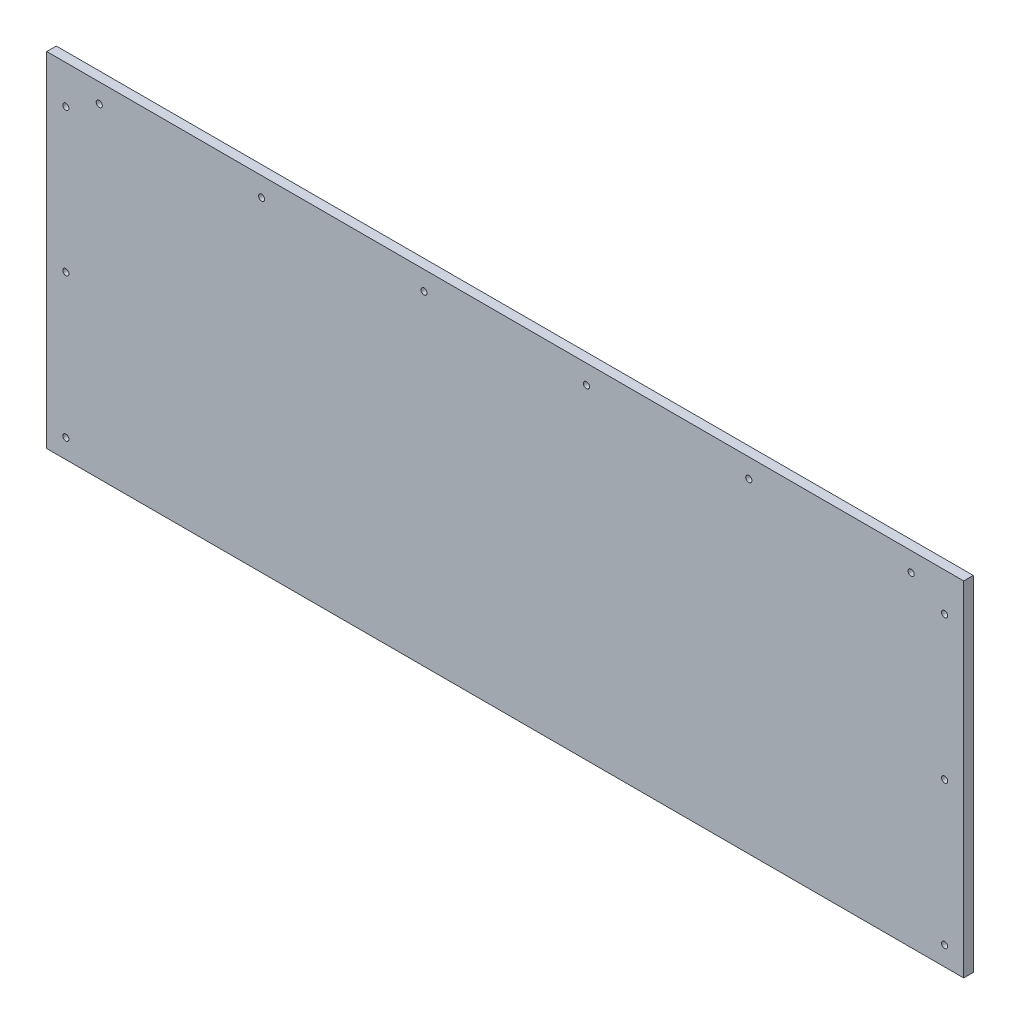
ISO-10303-21;
HEADER;
FILE_DESCRIPTION(('STEP AP214'),'2;1');
FILE_NAME('part.step','',(''),(''),'','','');
FILE_SCHEMA(('AUTOMOTIVE_DESIGN { 1 0 10303 214 1 1 1 1 }'));
ENDSEC;
DATA;
#1=APPLICATION_CONTEXT('core data for automotive mechanical design processes');
#2=APPLICATION_PROTOCOL_DEFINITION('international standard','automotive_design',2000,#1);
#3=PRODUCT_CONTEXT('',#1,'mechanical');
#4=PRODUCT('Part','Part','',(#3));
#5=PRODUCT_RELATED_PRODUCT_CATEGORY('part','',(#4));
#6=PRODUCT_DEFINITION_FORMATION('','',#4);
#7=PRODUCT_DEFINITION_CONTEXT('part definition',#1,'design');
#8=PRODUCT_DEFINITION('design','',#6,#7);
#9=PRODUCT_DEFINITION_SHAPE('','',#8);
#10=(LENGTH_UNIT() NAMED_UNIT(*) SI_UNIT(.MILLI.,.METRE.));
#11=(NAMED_UNIT(*) PLANE_ANGLE_UNIT() SI_UNIT($,.RADIAN.));
#12=(NAMED_UNIT(*) SI_UNIT($,.STERADIAN.) SOLID_ANGLE_UNIT());
#13=UNCERTAINTY_MEASURE_WITH_UNIT(LENGTH_MEASURE(1.E-05),#10,'distance_accuracy_value','');
#14=(GEOMETRIC_REPRESENTATION_CONTEXT(3) GLOBAL_UNCERTAINTY_ASSIGNED_CONTEXT((#13)) GLOBAL_UNIT_ASSIGNED_CONTEXT((#10,
#11,#12)) REPRESENTATION_CONTEXT('',''));
#15=CARTESIAN_POINT('',(0.,0.,0.));
#16=DIRECTION('',(0.,0.,1.));
#17=DIRECTION('',(1.,0.,0.));
#18=AXIS2_PLACEMENT_3D('',#15,#16,#17);
#19=CARTESIAN_POINT('',(0.,0.,6.35));
#20=DIRECTION('',(0.,0.,1.));
#21=DIRECTION('',(1.,0.,0.));
#22=AXIS2_PLACEMENT_3D('',#19,#20,#21);
#23=PLANE('',#22);
#24=CARTESIAN_POINT('',(34.925,215.9,6.35));
#25=DIRECTION('',(0.,0.,1.));
#26=DIRECTION('',(1.,0.,0.));
#27=AXIS2_PLACEMENT_3D('',#24,#25,#26);
#28=CIRCLE('',#27,2.032);
#29=CARTESIAN_POINT('',(36.957,215.9,6.35));
#30=VERTEX_POINT('',#29);
#31=EDGE_CURVE('E178',#30,#30,#28,.T.);
#32=ORIENTED_EDGE('',*,*,#31,.F.);
#33=EDGE_LOOP('',(#32));
#34=FACE_BOUND('',#33,.T.);
#35=CARTESIAN_POINT('',(142.875,215.9,6.35));
#36=DIRECTION('',(0.,0.,1.));
#37=DIRECTION('',(1.,0.,0.));
#38=AXIS2_PLACEMENT_3D('',#35,#36,#37);
#39=CIRCLE('',#38,2.032);
#40=CARTESIAN_POINT('',(144.907,215.9,6.35));
#41=VERTEX_POINT('',#40);
#42=EDGE_CURVE('E172',#41,#41,#39,.T.);
#43=ORIENTED_EDGE('',*,*,#42,.F.);
#44=EDGE_LOOP('',(#43));
#45=FACE_BOUND('',#44,.T.);
#46=CARTESIAN_POINT('',(250.825,215.9,6.35));
#47=DIRECTION('',(0.,0.,1.));
#48=DIRECTION('',(1.,0.,0.));
#49=AXIS2_PLACEMENT_3D('',#46,#47,#48);
#50=CIRCLE('',#49,2.03199999999995);
#51=CARTESIAN_POINT('',(252.857,215.9,6.35));
#52=VERTEX_POINT('',#51);
#53=EDGE_CURVE('E166',#52,#52,#50,.T.);
#54=ORIENTED_EDGE('',*,*,#53,.F.);
#55=EDGE_LOOP('',(#54));
#56=FACE_BOUND('',#55,.T.);
#57=CARTESIAN_POINT('',(358.775,215.9,6.35));
#58=DIRECTION('',(0.,0.,1.));
#59=DIRECTION('',(1.,0.,0.));
#60=AXIS2_PLACEMENT_3D('',#57,#58,#59);
#61=CIRCLE('',#60,2.03199999999995);
#62=CARTESIAN_POINT('',(360.807,215.9,6.35));
#63=VERTEX_POINT('',#62);
#64=EDGE_CURVE('E160',#63,#63,#61,.T.);
#65=ORIENTED_EDGE('',*,*,#64,.F.);
#66=EDGE_LOOP('',(#65));
#67=FACE_BOUND('',#66,.T.);
#68=CARTESIAN_POINT('',(466.725,215.9,6.35));
#69=DIRECTION('',(0.,0.,1.));
#70=DIRECTION('',(1.,0.,0.));
#71=AXIS2_PLACEMENT_3D('',#68,#69,#70);
#72=CIRCLE('',#71,2.03199999999995);
#73=CARTESIAN_POINT('',(468.757,215.9,6.35));
#74=VERTEX_POINT('',#73);
#75=EDGE_CURVE('E154',#74,#74,#72,.T.);
#76=ORIENTED_EDGE('',*,*,#75,.F.);
#77=EDGE_LOOP('',(#76));
#78=FACE_BOUND('',#77,.T.);
#79=CARTESIAN_POINT('',(574.675,215.9,6.35));
#80=DIRECTION('',(0.,0.,1.));
#81=DIRECTION('',(1.,0.,0.));
#82=AXIS2_PLACEMENT_3D('',#79,#80,#81);
#83=CIRCLE('',#82,2.03200000000001);
#84=CARTESIAN_POINT('',(576.707,215.9,6.35));
#85=VERTEX_POINT('',#84);
#86=EDGE_CURVE('E148',#85,#85,#83,.T.);
#87=ORIENTED_EDGE('',*,*,#86,.F.);
#88=EDGE_LOOP('',(#87));
#89=FACE_BOUND('',#88,.T.);
#90=CARTESIAN_POINT('',(596.899999999999,107.95,6.35));
#91=DIRECTION('',(0.,0.,-1.));
#92=DIRECTION('',(-1.,0.,0.));
#93=AXIS2_PLACEMENT_3D('',#90,#91,#92);
#94=CIRCLE('',#93,2.032);
#95=CARTESIAN_POINT('',(594.867999999999,107.95,6.35));
#96=VERTEX_POINT('',#95);
#97=EDGE_CURVE('E128',#96,#96,#94,.T.);
#98=ORIENTED_EDGE('',*,*,#97,.T.);
#99=EDGE_LOOP('',(#98));
#100=FACE_BOUND('',#99,.T.);
#101=DIRECTION('',(1.,0.,0.));
#102=VECTOR('',#101,1.);
#103=CARTESIAN_POINT('',(0.,0.,6.35));
#104=LINE('',#103,#102);
#105=CARTESIAN_POINT('',(0.,0.,6.35));
#106=VERTEX_POINT('',#105);
#107=CARTESIAN_POINT('',(609.6,0.,6.35));
#108=VERTEX_POINT('',#107);
#109=EDGE_CURVE('E86',#106,#108,#104,.T.);
#110=ORIENTED_EDGE('',*,*,#109,.T.);
#111=DIRECTION('',(0.,1.,0.));
#112=VECTOR('',#111,1.);
#113=CARTESIAN_POINT('',(609.6,0.,6.35));
#114=LINE('',#113,#112);
#115=CARTESIAN_POINT('',(609.6,228.6,6.35));
#116=VERTEX_POINT('',#115);
#117=EDGE_CURVE('E78',#108,#116,#114,.T.);
#118=ORIENTED_EDGE('',*,*,#117,.T.);
#119=DIRECTION('',(1.,0.,0.));
#120=VECTOR('',#119,1.);
#121=CARTESIAN_POINT('',(0.,228.6,6.35));
#122=LINE('',#121,#120);
#123=CARTESIAN_POINT('',(0.,228.6,6.35));
#124=VERTEX_POINT('',#123);
#125=EDGE_CURVE('E85',#124,#116,#122,.T.);
#126=ORIENTED_EDGE('',*,*,#125,.F.);
#127=DIRECTION('',(0.,1.,0.));
#128=VECTOR('',#127,1.);
#129=CARTESIAN_POINT('',(0.,0.,6.35));
#130=LINE('',#129,#128);
#131=EDGE_CURVE('E95',#106,#124,#130,.T.);
#132=ORIENTED_EDGE('',*,*,#131,.F.);
#133=EDGE_LOOP('',(#110,#118,#126,#132));
#134=FACE_BOUND('',#133,.T.);
#135=CARTESIAN_POINT('',(12.7,203.2,6.35));
#136=DIRECTION('',(0.,0.,1.));
#137=DIRECTION('',(1.,0.,0.));
#138=AXIS2_PLACEMENT_3D('',#135,#136,#137);
#139=CIRCLE('',#138,2.032);
#140=CARTESIAN_POINT('',(14.732,203.2,6.35));
#141=VERTEX_POINT('',#140);
#142=EDGE_CURVE('E112',#141,#141,#139,.T.);
#143=ORIENTED_EDGE('',*,*,#142,.F.);
#144=EDGE_LOOP('',(#143));
#145=FACE_BOUND('',#144,.T.);
#146=CARTESIAN_POINT('',(12.700000000001,107.95,6.35));
#147=DIRECTION('',(0.,0.,1.));
#148=DIRECTION('',(1.,0.,0.));
#149=AXIS2_PLACEMENT_3D('',#146,#147,#148);
#150=CIRCLE('',#149,2.032);
#151=CARTESIAN_POINT('',(14.732000000001,107.95,6.35));
#152=VERTEX_POINT('',#151);
#153=EDGE_CURVE('E115',#152,#152,#150,.T.);
#154=ORIENTED_EDGE('',*,*,#153,.F.);
#155=EDGE_LOOP('',(#154));
#156=FACE_BOUND('',#155,.T.);
#157=CARTESIAN_POINT('',(12.700000000002,12.7,6.35));
#158=DIRECTION('',(0.,0.,1.));
#159=DIRECTION('',(1.,0.,0.));
#160=AXIS2_PLACEMENT_3D('',#157,#158,#159);
#161=CIRCLE('',#160,2.032);
#162=CARTESIAN_POINT('',(14.732000000002,12.7,6.35));
#163=VERTEX_POINT('',#162);
#164=EDGE_CURVE('E140',#163,#163,#161,.T.);
#165=ORIENTED_EDGE('',*,*,#164,.F.);
#166=EDGE_LOOP('',(#165));
#167=FACE_BOUND('',#166,.T.);
#168=CARTESIAN_POINT('',(596.899999999998,12.7,6.35));
#169=DIRECTION('',(0.,0.,-1.));
#170=DIRECTION('',(-1.,0.,0.));
#171=AXIS2_PLACEMENT_3D('',#168,#169,#170);
#172=CIRCLE('',#171,2.03200000000011);
#173=CARTESIAN_POINT('',(594.867999999998,12.7,6.35));
#174=VERTEX_POINT('',#173);
#175=EDGE_CURVE('E134',#174,#174,#172,.T.);
#176=ORIENTED_EDGE('',*,*,#175,.T.);
#177=EDGE_LOOP('',(#176));
#178=FACE_BOUND('',#177,.T.);
#179=CARTESIAN_POINT('',(596.9,203.2,6.35));
#180=DIRECTION('',(0.,0.,-1.));
#181=DIRECTION('',(-1.,0.,0.));
#182=AXIS2_PLACEMENT_3D('',#179,#180,#181);
#183=CIRCLE('',#182,2.032);
#184=CARTESIAN_POINT('',(594.868,203.2,6.35));
#185=VERTEX_POINT('',#184);
#186=EDGE_CURVE('E121',#185,#185,#183,.T.);
#187=ORIENTED_EDGE('',*,*,#186,.T.);
#188=EDGE_LOOP('',(#187));
#189=FACE_BOUND('',#188,.T.);
#190=ADVANCED_FACE('F36',(#34,#45,#56,#67,#78,#89,#100,#134,#145,#156,#167,#178,#189),#23,.T.);
#191=CARTESIAN_POINT('',(0.,0.,0.));
#192=DIRECTION('',(0.,0.,1.));
#193=DIRECTION('',(1.,0.,0.));
#194=AXIS2_PLACEMENT_3D('',#191,#192,#193);
#195=PLANE('',#194);
#196=CARTESIAN_POINT('',(34.925,215.9,0.));
#197=DIRECTION('',(0.,0.,1.));
#198=DIRECTION('',(1.,0.,0.));
#199=AXIS2_PLACEMENT_3D('',#196,#197,#198);
#200=CIRCLE('',#199,2.032);
#201=CARTESIAN_POINT('',(36.957,215.9,0.));
#202=VERTEX_POINT('',#201);
#203=EDGE_CURVE('E122',#202,#202,#200,.T.);
#204=ORIENTED_EDGE('',*,*,#203,.T.);
#205=EDGE_LOOP('',(#204));
#206=FACE_BOUND('',#205,.T.);
#207=CARTESIAN_POINT('',(142.875,215.9,0.));
#208=DIRECTION('',(0.,0.,1.));
#209=DIRECTION('',(1.,0.,0.));
#210=AXIS2_PLACEMENT_3D('',#207,#208,#209);
#211=CIRCLE('',#210,2.032);
#212=CARTESIAN_POINT('',(144.907,215.9,0.));
#213=VERTEX_POINT('',#212);
#214=EDGE_CURVE('E175',#213,#213,#211,.T.);
#215=ORIENTED_EDGE('',*,*,#214,.T.);
#216=EDGE_LOOP('',(#215));
#217=FACE_BOUND('',#216,.T.);
#218=CARTESIAN_POINT('',(250.825,215.9,0.));
#219=DIRECTION('',(0.,0.,1.));
#220=DIRECTION('',(1.,0.,0.));
#221=AXIS2_PLACEMENT_3D('',#218,#219,#220);
#222=CIRCLE('',#221,2.03199999999995);
#223=CARTESIAN_POINT('',(252.857,215.9,0.));
#224=VERTEX_POINT('',#223);
#225=EDGE_CURVE('E169',#224,#224,#222,.T.);
#226=ORIENTED_EDGE('',*,*,#225,.T.);
#227=EDGE_LOOP('',(#226));
#228=FACE_BOUND('',#227,.T.);
#229=CARTESIAN_POINT('',(358.775,215.9,0.));
#230=DIRECTION('',(0.,0.,1.));
#231=DIRECTION('',(1.,0.,0.));
#232=AXIS2_PLACEMENT_3D('',#229,#230,#231);
#233=CIRCLE('',#232,2.03199999999995);
#234=CARTESIAN_POINT('',(360.807,215.9,0.));
#235=VERTEX_POINT('',#234);
#236=EDGE_CURVE('E163',#235,#235,#233,.T.);
#237=ORIENTED_EDGE('',*,*,#236,.T.);
#238=EDGE_LOOP('',(#237));
#239=FACE_BOUND('',#238,.T.);
#240=CARTESIAN_POINT('',(466.725,215.9,0.));
#241=DIRECTION('',(0.,0.,1.));
#242=DIRECTION('',(1.,0.,0.));
#243=AXIS2_PLACEMENT_3D('',#240,#241,#242);
#244=CIRCLE('',#243,2.03199999999995);
#245=CARTESIAN_POINT('',(468.757,215.9,0.));
#246=VERTEX_POINT('',#245);
#247=EDGE_CURVE('E157',#246,#246,#244,.T.);
#248=ORIENTED_EDGE('',*,*,#247,.T.);
#249=EDGE_LOOP('',(#248));
#250=FACE_BOUND('',#249,.T.);
#251=CARTESIAN_POINT('',(574.675,215.9,0.));
#252=DIRECTION('',(0.,0.,1.));
#253=DIRECTION('',(1.,0.,0.));
#254=AXIS2_PLACEMENT_3D('',#251,#252,#253);
#255=CIRCLE('',#254,2.03200000000001);
#256=CARTESIAN_POINT('',(576.707,215.9,0.));
#257=VERTEX_POINT('',#256);
#258=EDGE_CURVE('E151',#257,#257,#255,.T.);
#259=ORIENTED_EDGE('',*,*,#258,.T.);
#260=EDGE_LOOP('',(#259));
#261=FACE_BOUND('',#260,.T.);
#262=CARTESIAN_POINT('',(12.700000000002,12.7,0.));
#263=DIRECTION('',(0.,0.,1.));
#264=DIRECTION('',(1.,0.,0.));
#265=AXIS2_PLACEMENT_3D('',#262,#263,#264);
#266=CIRCLE('',#265,2.032);
#267=CARTESIAN_POINT('',(14.732000000002,12.7,0.));
#268=VERTEX_POINT('',#267);
#269=EDGE_CURVE('E137',#268,#268,#266,.T.);
#270=ORIENTED_EDGE('',*,*,#269,.T.);
#271=EDGE_LOOP('',(#270));
#272=FACE_BOUND('',#271,.T.);
#273=CARTESIAN_POINT('',(12.700000000001,107.95,0.));
#274=DIRECTION('',(0.,0.,1.));
#275=DIRECTION('',(1.,0.,0.));
#276=AXIS2_PLACEMENT_3D('',#273,#274,#275);
#277=CIRCLE('',#276,2.032);
#278=CARTESIAN_POINT('',(14.732000000001,107.95,0.));
#279=VERTEX_POINT('',#278);
#280=EDGE_CURVE('E143',#279,#279,#277,.T.);
#281=ORIENTED_EDGE('',*,*,#280,.T.);
#282=EDGE_LOOP('',(#281));
#283=FACE_BOUND('',#282,.T.);
#284=CARTESIAN_POINT('',(12.7,203.2,0.));
#285=DIRECTION('',(0.,0.,1.));
#286=DIRECTION('',(1.,0.,0.));
#287=AXIS2_PLACEMENT_3D('',#284,#285,#286);
#288=CIRCLE('',#287,2.032);
#289=CARTESIAN_POINT('',(14.732,203.2,0.));
#290=VERTEX_POINT('',#289);
#291=EDGE_CURVE('E102',#290,#290,#288,.T.);
#292=ORIENTED_EDGE('',*,*,#291,.T.);
#293=EDGE_LOOP('',(#292));
#294=FACE_BOUND('',#293,.T.);
#295=DIRECTION('',(1.,0.,0.));
#296=VECTOR('',#295,1.);
#297=CARTESIAN_POINT('',(0.,0.,0.));
#298=LINE('',#297,#296);
#299=CARTESIAN_POINT('',(0.,0.,0.));
#300=VERTEX_POINT('',#299);
#301=CARTESIAN_POINT('',(609.6,0.,0.));
#302=VERTEX_POINT('',#301);
#303=EDGE_CURVE('E100',#300,#302,#298,.T.);
#304=ORIENTED_EDGE('',*,*,#303,.F.);
#305=DIRECTION('',(0.,1.,0.));
#306=VECTOR('',#305,1.);
#307=CARTESIAN_POINT('',(0.,0.,0.));
#308=LINE('',#307,#306);
#309=CARTESIAN_POINT('',(0.,228.6,0.));
#310=VERTEX_POINT('',#309);
#311=EDGE_CURVE('E106',#300,#310,#308,.T.);
#312=ORIENTED_EDGE('',*,*,#311,.T.);
#313=DIRECTION('',(1.,0.,0.));
#314=VECTOR('',#313,1.);
#315=CARTESIAN_POINT('',(0.,228.6,0.));
#316=LINE('',#315,#314);
#317=CARTESIAN_POINT('',(609.6,228.6,0.));
#318=VERTEX_POINT('',#317);
#319=EDGE_CURVE('E104',#310,#318,#316,.T.);
#320=ORIENTED_EDGE('',*,*,#319,.T.);
#321=DIRECTION('',(0.,1.,0.));
#322=VECTOR('',#321,1.);
#323=CARTESIAN_POINT('',(609.6,0.,0.));
#324=LINE('',#323,#322);
#325=EDGE_CURVE('E91',#302,#318,#324,.T.);
#326=ORIENTED_EDGE('',*,*,#325,.F.);
#327=EDGE_LOOP('',(#304,#312,#320,#326));
#328=FACE_BOUND('',#327,.T.);
#329=CARTESIAN_POINT('',(596.899999999998,12.7,0.));
#330=DIRECTION('',(0.,0.,-1.));
#331=DIRECTION('',(-1.,0.,0.));
#332=AXIS2_PLACEMENT_3D('',#329,#330,#331);
#333=CIRCLE('',#332,2.03200000000011);
#334=CARTESIAN_POINT('',(594.867999999998,12.7,0.));
#335=VERTEX_POINT('',#334);
#336=EDGE_CURVE('E131',#335,#335,#333,.T.);
#337=ORIENTED_EDGE('',*,*,#336,.F.);
#338=EDGE_LOOP('',(#337));
#339=FACE_BOUND('',#338,.T.);
#340=CARTESIAN_POINT('',(596.899999999999,107.95,0.));
#341=DIRECTION('',(0.,0.,-1.));
#342=DIRECTION('',(-1.,0.,0.));
#343=AXIS2_PLACEMENT_3D('',#340,#341,#342);
#344=CIRCLE('',#343,2.032);
#345=CARTESIAN_POINT('',(594.867999999999,107.95,0.));
#346=VERTEX_POINT('',#345);
#347=EDGE_CURVE('E125',#346,#346,#344,.T.);
#348=ORIENTED_EDGE('',*,*,#347,.F.);
#349=EDGE_LOOP('',(#348));
#350=FACE_BOUND('',#349,.T.);
#351=CARTESIAN_POINT('',(596.9,203.2,0.));
#352=DIRECTION('',(0.,0.,-1.));
#353=DIRECTION('',(-1.,0.,0.));
#354=AXIS2_PLACEMENT_3D('',#351,#352,#353);
#355=CIRCLE('',#354,2.032);
#356=CARTESIAN_POINT('',(594.868,203.2,0.));
#357=VERTEX_POINT('',#356);
#358=EDGE_CURVE('E118',#357,#357,#355,.T.);
#359=ORIENTED_EDGE('',*,*,#358,.F.);
#360=EDGE_LOOP('',(#359));
#361=FACE_BOUND('',#360,.T.);
#362=ADVANCED_FACE('F184',(#206,#217,#228,#239,#250,#261,#272,#283,#294,#328,#339,#350,#361),
#195,.F.);
#363=CARTESIAN_POINT('',(0.,0.,6.35));
#364=DIRECTION('',(0.,1.,0.));
#365=DIRECTION('',(0.,0.,1.));
#366=AXIS2_PLACEMENT_3D('',#363,#364,#365);
#367=PLANE('',#366);
#368=ORIENTED_EDGE('',*,*,#303,.T.);
#369=DIRECTION('',(0.,0.,-1.));
#370=VECTOR('',#369,1.);
#371=CARTESIAN_POINT('',(609.6,0.,6.35));
#372=LINE('',#371,#370);
#373=EDGE_CURVE('E11',#108,#302,#372,.T.);
#374=ORIENTED_EDGE('',*,*,#373,.F.);
#375=ORIENTED_EDGE('',*,*,#109,.F.);
#376=DIRECTION('',(0.,0.,-1.));
#377=VECTOR('',#376,1.);
#378=CARTESIAN_POINT('',(0.,0.,6.35));
#379=LINE('',#378,#377);
#380=EDGE_CURVE('E53',#106,#300,#379,.T.);
#381=ORIENTED_EDGE('',*,*,#380,.T.);
#382=EDGE_LOOP('',(#368,#374,#375,#381));
#383=FACE_BOUND('',#382,.T.);
#384=ADVANCED_FACE('F38',(#383),#367,.F.);
#385=CARTESIAN_POINT('',(609.6,0.,6.35));
#386=DIRECTION('',(-1.,0.,0.));
#387=DIRECTION('',(0.,0.,1.));
#388=AXIS2_PLACEMENT_3D('',#385,#386,#387);
#389=PLANE('',#388);
#390=ORIENTED_EDGE('',*,*,#325,.T.);
#391=DIRECTION('',(0.,0.,-1.));
#392=VECTOR('',#391,1.);
#393=CARTESIAN_POINT('',(609.6,228.6,6.35));
#394=LINE('',#393,#392);
#395=EDGE_CURVE('E45',#116,#318,#394,.T.);
#396=ORIENTED_EDGE('',*,*,#395,.F.);
#397=ORIENTED_EDGE('',*,*,#117,.F.);
#398=ORIENTED_EDGE('',*,*,#373,.T.);
#399=EDGE_LOOP('',(#390,#396,#397,#398));
#400=FACE_BOUND('',#399,.T.);
#401=ADVANCED_FACE('F90',(#400),#389,.F.);
#402=CARTESIAN_POINT('',(0.,228.6,6.35));
#403=DIRECTION('',(0.,1.,0.));
#404=DIRECTION('',(0.,0.,1.));
#405=AXIS2_PLACEMENT_3D('',#402,#403,#404);
#406=PLANE('',#405);
#407=ORIENTED_EDGE('',*,*,#319,.F.);
#408=DIRECTION('',(0.,0.,-1.));
#409=VECTOR('',#408,1.);
#410=CARTESIAN_POINT('',(0.,228.6,6.35));
#411=LINE('',#410,#409);
#412=EDGE_CURVE('E67',#124,#310,#411,.T.);
#413=ORIENTED_EDGE('',*,*,#412,.F.);
#414=ORIENTED_EDGE('',*,*,#125,.T.);
#415=ORIENTED_EDGE('',*,*,#395,.T.);
#416=EDGE_LOOP('',(#407,#413,#414,#415));
#417=FACE_BOUND('',#416,.T.);
#418=ADVANCED_FACE('F94',(#417),#406,.T.);
#419=CARTESIAN_POINT('',(0.,0.,6.35));
#420=DIRECTION('',(-1.,0.,0.));
#421=DIRECTION('',(0.,0.,1.));
#422=AXIS2_PLACEMENT_3D('',#419,#420,#421);
#423=PLANE('',#422);
#424=ORIENTED_EDGE('',*,*,#311,.F.);
#425=ORIENTED_EDGE('',*,*,#380,.F.);
#426=ORIENTED_EDGE('',*,*,#131,.T.);
#427=ORIENTED_EDGE('',*,*,#412,.T.);
#428=EDGE_LOOP('',(#424,#425,#426,#427));
#429=FACE_BOUND('',#428,.T.);
#430=ADVANCED_FACE('F230',(#429),#423,.T.);
#431=CARTESIAN_POINT('',(12.7,203.2,0.));
#432=DIRECTION('',(0.,0.,1.));
#433=DIRECTION('',(1.,0.,0.));
#434=AXIS2_PLACEMENT_3D('',#431,#432,#433);
#435=CYLINDRICAL_SURFACE('',#434,2.032);
#436=ORIENTED_EDGE('',*,*,#291,.F.);
#437=EDGE_LOOP('',(#436));
#438=FACE_BOUND('',#437,.T.);
#439=ORIENTED_EDGE('',*,*,#142,.T.);
#440=EDGE_LOOP('',(#439));
#441=FACE_BOUND('',#440,.T.);
#442=ADVANCED_FACE('F227',(#438,#441),#435,.F.);
#443=CARTESIAN_POINT('',(12.700000000001,107.95,0.));
#444=DIRECTION('',(0.,0.,1.));
#445=DIRECTION('',(1.,0.,0.));
#446=AXIS2_PLACEMENT_3D('',#443,#444,#445);
#447=CYLINDRICAL_SURFACE('',#446,2.032);
#448=ORIENTED_EDGE('',*,*,#280,.F.);
#449=EDGE_LOOP('',(#448));
#450=FACE_BOUND('',#449,.T.);
#451=ORIENTED_EDGE('',*,*,#153,.T.);
#452=EDGE_LOOP('',(#451));
#453=FACE_BOUND('',#452,.T.);
#454=ADVANCED_FACE('F229',(#450,#453),#447,.F.);
#455=CARTESIAN_POINT('',(12.700000000002,12.7,0.));
#456=DIRECTION('',(0.,0.,1.));
#457=DIRECTION('',(1.,0.,0.));
#458=AXIS2_PLACEMENT_3D('',#455,#456,#457);
#459=CYLINDRICAL_SURFACE('',#458,2.032);
#460=ORIENTED_EDGE('',*,*,#269,.F.);
#461=EDGE_LOOP('',(#460));
#462=FACE_BOUND('',#461,.T.);
#463=ORIENTED_EDGE('',*,*,#164,.T.);
#464=EDGE_LOOP('',(#463));
#465=FACE_BOUND('',#464,.T.);
#466=ADVANCED_FACE('F222',(#462,#465),#459,.F.);
#467=CARTESIAN_POINT('',(596.899999999998,12.7,0.));
#468=DIRECTION('',(0.,0.,1.));
#469=DIRECTION('',(1.,0.,0.));
#470=AXIS2_PLACEMENT_3D('',#467,#468,#469);
#471=CYLINDRICAL_SURFACE('',#470,2.03200000000011);
#472=ORIENTED_EDGE('',*,*,#336,.T.);
#473=EDGE_LOOP('',(#472));
#474=FACE_BOUND('',#473,.T.);
#475=ORIENTED_EDGE('',*,*,#175,.F.);
#476=EDGE_LOOP('',(#475));
#477=FACE_BOUND('',#476,.T.);
#478=ADVANCED_FACE('F212',(#474,#477),#471,.F.);
#479=CARTESIAN_POINT('',(596.899999999999,107.95,0.));
#480=DIRECTION('',(0.,0.,1.));
#481=DIRECTION('',(1.,0.,0.));
#482=AXIS2_PLACEMENT_3D('',#479,#480,#481);
#483=CYLINDRICAL_SURFACE('',#482,2.032);
#484=ORIENTED_EDGE('',*,*,#347,.T.);
#485=EDGE_LOOP('',(#484));
#486=FACE_BOUND('',#485,.T.);
#487=ORIENTED_EDGE('',*,*,#97,.F.);
#488=EDGE_LOOP('',(#487));
#489=FACE_BOUND('',#488,.T.);
#490=ADVANCED_FACE('F209',(#486,#489),#483,.F.);
#491=CARTESIAN_POINT('',(596.9,203.2,0.));
#492=DIRECTION('',(0.,0.,1.));
#493=DIRECTION('',(1.,0.,0.));
#494=AXIS2_PLACEMENT_3D('',#491,#492,#493);
#495=CYLINDRICAL_SURFACE('',#494,2.032);
#496=ORIENTED_EDGE('',*,*,#358,.T.);
#497=EDGE_LOOP('',(#496));
#498=FACE_BOUND('',#497,.T.);
#499=ORIENTED_EDGE('',*,*,#186,.F.);
#500=EDGE_LOOP('',(#499));
#501=FACE_BOUND('',#500,.T.);
#502=ADVANCED_FACE('F211',(#498,#501),#495,.F.);
#503=CARTESIAN_POINT('',(574.675,215.9,0.));
#504=DIRECTION('',(0.,0.,1.));
#505=DIRECTION('',(1.,0.,0.));
#506=AXIS2_PLACEMENT_3D('',#503,#504,#505);
#507=CYLINDRICAL_SURFACE('',#506,2.03200000000001);
#508=ORIENTED_EDGE('',*,*,#258,.F.);
#509=EDGE_LOOP('',(#508));
#510=FACE_BOUND('',#509,.T.);
#511=ORIENTED_EDGE('',*,*,#86,.T.);
#512=EDGE_LOOP('',(#511));
#513=FACE_BOUND('',#512,.T.);
#514=ADVANCED_FACE('F219',(#510,#513),#507,.F.);
#515=CARTESIAN_POINT('',(466.725,215.9,0.));
#516=DIRECTION('',(0.,0.,1.));
#517=DIRECTION('',(1.,0.,0.));
#518=AXIS2_PLACEMENT_3D('',#515,#516,#517);
#519=CYLINDRICAL_SURFACE('',#518,2.03199999999995);
#520=ORIENTED_EDGE('',*,*,#247,.F.);
#521=EDGE_LOOP('',(#520));
#522=FACE_BOUND('',#521,.T.);
#523=ORIENTED_EDGE('',*,*,#75,.T.);
#524=EDGE_LOOP('',(#523));
#525=FACE_BOUND('',#524,.T.);
#526=ADVANCED_FACE('F334',(#522,#525),#519,.F.);
#527=CARTESIAN_POINT('',(358.775,215.9,0.));
#528=DIRECTION('',(0.,0.,1.));
#529=DIRECTION('',(1.,0.,0.));
#530=AXIS2_PLACEMENT_3D('',#527,#528,#529);
#531=CYLINDRICAL_SURFACE('',#530,2.03199999999995);
#532=ORIENTED_EDGE('',*,*,#236,.F.);
#533=EDGE_LOOP('',(#532));
#534=FACE_BOUND('',#533,.T.);
#535=ORIENTED_EDGE('',*,*,#64,.T.);
#536=EDGE_LOOP('',(#535));
#537=FACE_BOUND('',#536,.T.);
#538=ADVANCED_FACE('F338',(#534,#537),#531,.F.);
#539=CARTESIAN_POINT('',(250.825,215.9,0.));
#540=DIRECTION('',(0.,0.,1.));
#541=DIRECTION('',(1.,0.,0.));
#542=AXIS2_PLACEMENT_3D('',#539,#540,#541);
#543=CYLINDRICAL_SURFACE('',#542,2.03199999999995);
#544=ORIENTED_EDGE('',*,*,#225,.F.);
#545=EDGE_LOOP('',(#544));
#546=FACE_BOUND('',#545,.T.);
#547=ORIENTED_EDGE('',*,*,#53,.T.);
#548=EDGE_LOOP('',(#547));
#549=FACE_BOUND('',#548,.T.);
#550=ADVANCED_FACE('F342',(#546,#549),#543,.F.);
#551=CARTESIAN_POINT('',(142.875,215.9,0.));
#552=DIRECTION('',(0.,0.,1.));
#553=DIRECTION('',(1.,0.,0.));
#554=AXIS2_PLACEMENT_3D('',#551,#552,#553);
#555=CYLINDRICAL_SURFACE('',#554,2.032);
#556=ORIENTED_EDGE('',*,*,#214,.F.);
#557=EDGE_LOOP('',(#556));
#558=FACE_BOUND('',#557,.T.);
#559=ORIENTED_EDGE('',*,*,#42,.T.);
#560=EDGE_LOOP('',(#559));
#561=FACE_BOUND('',#560,.T.);
#562=ADVANCED_FACE('F190',(#558,#561),#555,.F.);
#563=CARTESIAN_POINT('',(34.925,215.9,0.));
#564=DIRECTION('',(0.,0.,1.));
#565=DIRECTION('',(1.,0.,0.));
#566=AXIS2_PLACEMENT_3D('',#563,#564,#565);
#567=CYLINDRICAL_SURFACE('',#566,2.032);
#568=ORIENTED_EDGE('',*,*,#203,.F.);
#569=EDGE_LOOP('',(#568));
#570=FACE_BOUND('',#569,.T.);
#571=ORIENTED_EDGE('',*,*,#31,.T.);
#572=EDGE_LOOP('',(#571));
#573=FACE_BOUND('',#572,.T.);
#574=ADVANCED_FACE('F187',(#570,#573),#567,.F.);
#575=CLOSED_SHELL('',(#190,#362,#384,#401,#418,#430,#442,#454,#466,#478,#490,#502,#514,#526,
#538,#550,#562,#574));
#576=MANIFOLD_SOLID_BREP('B2',#575);
#577=ADVANCED_BREP_SHAPE_REPRESENTATION('',(#18,#576),#14);
#578=SHAPE_DEFINITION_REPRESENTATION(#9,#577);
ENDSEC;
END-ISO-10303-21;
